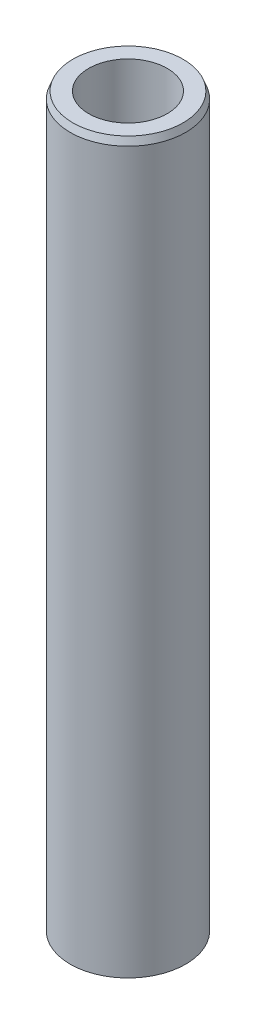
ISO-10303-21;
HEADER;
FILE_DESCRIPTION(('STEP AP214'),'2;1');
FILE_NAME('part.step','',(''),(''),'','','');
FILE_SCHEMA(('AUTOMOTIVE_DESIGN { 1 0 10303 214 1 1 1 1 }'));
ENDSEC;
DATA;
#1=APPLICATION_CONTEXT('core data for automotive mechanical design processes');
#2=APPLICATION_PROTOCOL_DEFINITION('international standard','automotive_design',2000,#1);
#3=PRODUCT_CONTEXT('',#1,'mechanical');
#4=PRODUCT('Part','Part','',(#3));
#5=PRODUCT_RELATED_PRODUCT_CATEGORY('part','',(#4));
#6=PRODUCT_DEFINITION_FORMATION('','',#4);
#7=PRODUCT_DEFINITION_CONTEXT('part definition',#1,'design');
#8=PRODUCT_DEFINITION('design','',#6,#7);
#9=PRODUCT_DEFINITION_SHAPE('','',#8);
#10=(LENGTH_UNIT() NAMED_UNIT(*) SI_UNIT(.MILLI.,.METRE.));
#11=(NAMED_UNIT(*) PLANE_ANGLE_UNIT() SI_UNIT($,.RADIAN.));
#12=(NAMED_UNIT(*) SI_UNIT($,.STERADIAN.) SOLID_ANGLE_UNIT());
#13=UNCERTAINTY_MEASURE_WITH_UNIT(LENGTH_MEASURE(1.E-05),#10,'distance_accuracy_value','');
#14=(GEOMETRIC_REPRESENTATION_CONTEXT(3) GLOBAL_UNCERTAINTY_ASSIGNED_CONTEXT((#13)) GLOBAL_UNIT_ASSIGNED_CONTEXT((#10,
#11,#12)) REPRESENTATION_CONTEXT('',''));
#15=CARTESIAN_POINT('',(0.,0.,0.));
#16=DIRECTION('',(0.,0.,1.));
#17=DIRECTION('',(1.,0.,0.));
#18=AXIS2_PLACEMENT_3D('',#15,#16,#17);
#19=CARTESIAN_POINT('',(0.,600.,0.));
#20=DIRECTION('',(0.,-1.,0.));
#21=DIRECTION('',(0.,0.,-1.));
#22=AXIS2_PLACEMENT_3D('',#19,#20,#21);
#23=CYLINDRICAL_SURFACE('',#22,47.5);
#24=CARTESIAN_POINT('',(0.,594.264172693143,0.));
#25=DIRECTION('',(0.,1.,0.));
#26=DIRECTION('',(0.,0.,1.));
#27=AXIS2_PLACEMENT_3D('',#24,#25,#26);
#28=CIRCLE('',#27,47.5);
#29=CARTESIAN_POINT('',(0.,594.264172693143,47.5));
#30=VERTEX_POINT('',#29);
#31=EDGE_CURVE('E50',#30,#30,#28,.F.);
#32=ORIENTED_EDGE('',*,*,#31,.T.);
#33=EDGE_LOOP('',(#32));
#34=FACE_BOUND('',#33,.T.);
#35=CARTESIAN_POINT('',(0.,2.18278600747357,0.));
#36=DIRECTION('',(0.,1.,0.));
#37=DIRECTION('',(0.,0.,1.));
#38=AXIS2_PLACEMENT_3D('',#35,#36,#37);
#39=CIRCLE('',#38,47.5);
#40=CARTESIAN_POINT('',(0.,2.18278600747357,47.5));
#41=VERTEX_POINT('',#40);
#42=EDGE_CURVE('E51',#41,#41,#39,.T.);
#43=ORIENTED_EDGE('',*,*,#42,.T.);
#44=EDGE_LOOP('',(#43));
#45=FACE_BOUND('',#44,.T.);
#46=ADVANCED_FACE('F39',(#34,#45),#23,.T.);
#47=CARTESIAN_POINT('',(0.,600.,0.));
#48=DIRECTION('',(0.,1.,0.));
#49=DIRECTION('',(0.,0.,1.));
#50=AXIS2_PLACEMENT_3D('',#47,#48,#49);
#51=PLANE('',#50);
#52=CARTESIAN_POINT('',(0.,600.,0.));
#53=DIRECTION('',(0.,1.,0.));
#54=DIRECTION('',(0.,0.,1.));
#55=AXIS2_PLACEMENT_3D('',#52,#53,#54);
#56=CIRCLE('',#55,45.3172139925266);
#57=CARTESIAN_POINT('',(0.,600.,45.3172139925266));
#58=VERTEX_POINT('',#57);
#59=EDGE_CURVE('E54',#58,#58,#56,.T.);
#60=ORIENTED_EDGE('',*,*,#59,.T.);
#61=EDGE_LOOP('',(#60));
#62=FACE_BOUND('',#61,.T.);
#63=CARTESIAN_POINT('',(0.,600.,0.));
#64=DIRECTION('',(0.,1.,0.));
#65=DIRECTION('',(0.,0.,1.));
#66=AXIS2_PLACEMENT_3D('',#63,#64,#65);
#67=CIRCLE('',#66,32.2943179377662);
#68=CARTESIAN_POINT('',(0.,600.,32.2943179377662));
#69=VERTEX_POINT('',#68);
#70=EDGE_CURVE('E58',#69,#69,#67,.T.);
#71=ORIENTED_EDGE('',*,*,#70,.F.);
#72=EDGE_LOOP('',(#71));
#73=FACE_BOUND('',#72,.T.);
#74=ADVANCED_FACE('F69',(#62,#73),#51,.T.);
#75=CARTESIAN_POINT('',(0.,0.,0.));
#76=DIRECTION('',(0.,1.,0.));
#77=DIRECTION('',(0.,0.,1.));
#78=AXIS2_PLACEMENT_3D('',#75,#76,#77);
#79=PLANE('',#78);
#80=CARTESIAN_POINT('',(0.,0.,0.));
#81=DIRECTION('',(0.,1.,0.));
#82=DIRECTION('',(0.,0.,1.));
#83=AXIS2_PLACEMENT_3D('',#80,#81,#82);
#84=CIRCLE('',#83,41.7641726931428);
#85=CARTESIAN_POINT('',(0.,0.,41.7641726931428));
#86=VERTEX_POINT('',#85);
#87=EDGE_CURVE('E10',#86,#86,#84,.F.);
#88=ORIENTED_EDGE('',*,*,#87,.T.);
#89=EDGE_LOOP('',(#88));
#90=FACE_BOUND('',#89,.T.);
#91=CARTESIAN_POINT('',(0.,0.,0.));
#92=DIRECTION('',(0.,1.,0.));
#93=DIRECTION('',(0.,0.,1.));
#94=AXIS2_PLACEMENT_3D('',#91,#92,#93);
#95=CIRCLE('',#94,32.2943179377662);
#96=CARTESIAN_POINT('',(0.,0.,32.2943179377662));
#97=VERTEX_POINT('',#96);
#98=EDGE_CURVE('E63',#97,#97,#95,.T.);
#99=ORIENTED_EDGE('',*,*,#98,.T.);
#100=EDGE_LOOP('',(#99));
#101=FACE_BOUND('',#100,.T.);
#102=ADVANCED_FACE('F75',(#90,#101),#79,.F.);
#103=CARTESIAN_POINT('',(0.,600.,0.));
#104=DIRECTION('',(0.,-1.,0.));
#105=DIRECTION('',(0.,0.,-1.));
#106=AXIS2_PLACEMENT_3D('',#103,#104,#105);
#107=CYLINDRICAL_SURFACE('',#106,32.2943179377662);
#108=ORIENTED_EDGE('',*,*,#70,.T.);
#109=EDGE_LOOP('',(#108));
#110=FACE_BOUND('',#109,.T.);
#111=ORIENTED_EDGE('',*,*,#98,.F.);
#112=EDGE_LOOP('',(#111));
#113=FACE_BOUND('',#112,.T.);
#114=ADVANCED_FACE('F70',(#110,#113),#107,.F.);
#115=CARTESIAN_POINT('',(0.,600.,0.));
#116=DIRECTION('',(0.,-1.,0.));
#117=DIRECTION('',(0.,0.,-1.));
#118=AXIS2_PLACEMENT_3D('',#115,#116,#117);
#119=CONICAL_SURFACE('',#118,45.3172139925266,0.363630100953352);
#120=ORIENTED_EDGE('',*,*,#31,.F.);
#121=EDGE_LOOP('',(#120));
#122=FACE_BOUND('',#121,.T.);
#123=ORIENTED_EDGE('',*,*,#59,.F.);
#124=EDGE_LOOP('',(#123));
#125=FACE_BOUND('',#124,.T.);
#126=ADVANCED_FACE('F81',(#122,#125),#119,.T.);
#127=CARTESIAN_POINT('',(0.,2.18278600747357,0.));
#128=DIRECTION('',(0.,1.,0.));
#129=DIRECTION('',(0.,0.,1.));
#130=AXIS2_PLACEMENT_3D('',#127,#128,#129);
#131=CONICAL_SURFACE('',#130,47.5,1.20716622584155);
#132=ORIENTED_EDGE('',*,*,#87,.F.);
#133=EDGE_LOOP('',(#132));
#134=FACE_BOUND('',#133,.T.);
#135=ORIENTED_EDGE('',*,*,#42,.F.);
#136=EDGE_LOOP('',(#135));
#137=FACE_BOUND('',#136,.T.);
#138=ADVANCED_FACE('F45',(#134,#137),#131,.T.);
#139=CLOSED_SHELL('',(#46,#74,#102,#114,#126,#138));
#140=MANIFOLD_SOLID_BREP('B2',#139);
#141=ADVANCED_BREP_SHAPE_REPRESENTATION('',(#18,#140),#14);
#142=SHAPE_DEFINITION_REPRESENTATION(#9,#141);
ENDSEC;
END-ISO-10303-21;
